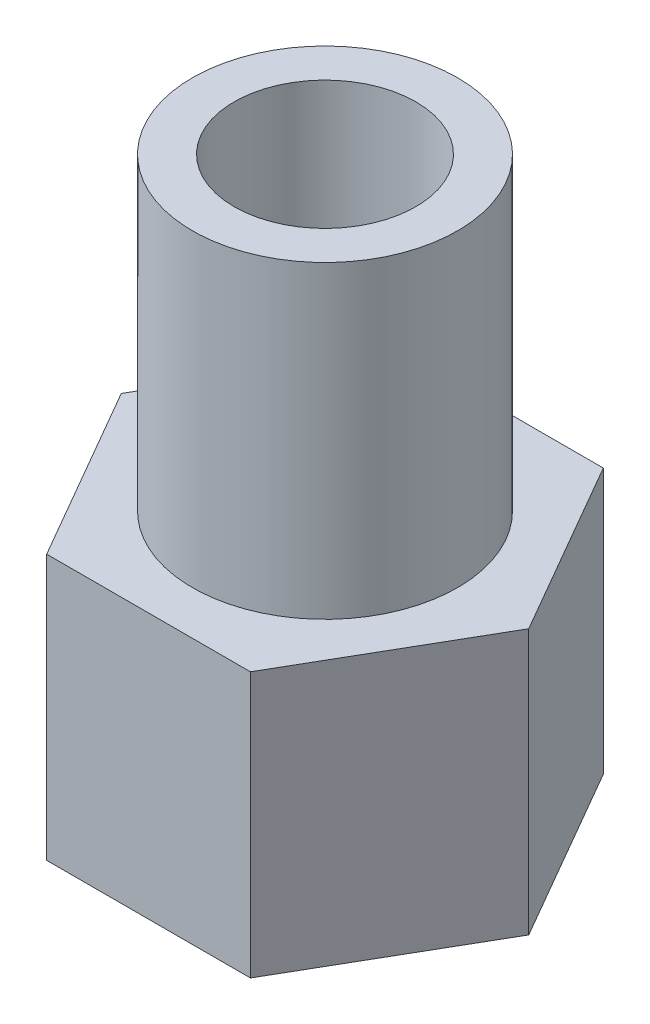
ISO-10303-21;
HEADER;
FILE_DESCRIPTION(('STEP AP214'),'2;1');
FILE_NAME('part.step','',(''),(''),'','','');
FILE_SCHEMA(('AUTOMOTIVE_DESIGN { 1 0 10303 214 1 1 1 1 }'));
ENDSEC;
DATA;
#1=APPLICATION_CONTEXT('core data for automotive mechanical design processes');
#2=APPLICATION_PROTOCOL_DEFINITION('international standard','automotive_design',2000,#1);
#3=PRODUCT_CONTEXT('',#1,'mechanical');
#4=PRODUCT('Part','Part','',(#3));
#5=PRODUCT_RELATED_PRODUCT_CATEGORY('part','',(#4));
#6=PRODUCT_DEFINITION_FORMATION('','',#4);
#7=PRODUCT_DEFINITION_CONTEXT('part definition',#1,'design');
#8=PRODUCT_DEFINITION('design','',#6,#7);
#9=PRODUCT_DEFINITION_SHAPE('','',#8);
#10=(LENGTH_UNIT() NAMED_UNIT(*) SI_UNIT(.MILLI.,.METRE.));
#11=(NAMED_UNIT(*) PLANE_ANGLE_UNIT() SI_UNIT($,.RADIAN.));
#12=(NAMED_UNIT(*) SI_UNIT($,.STERADIAN.) SOLID_ANGLE_UNIT());
#13=UNCERTAINTY_MEASURE_WITH_UNIT(LENGTH_MEASURE(1.E-05),#10,'distance_accuracy_value','');
#14=(GEOMETRIC_REPRESENTATION_CONTEXT(3) GLOBAL_UNCERTAINTY_ASSIGNED_CONTEXT((#13)) GLOBAL_UNIT_ASSIGNED_CONTEXT((#10,
#11,#12)) REPRESENTATION_CONTEXT('',''));
#15=CARTESIAN_POINT('',(0.,0.,0.));
#16=DIRECTION('',(0.,0.,1.));
#17=DIRECTION('',(1.,0.,0.));
#18=AXIS2_PLACEMENT_3D('',#15,#16,#17);
#19=CARTESIAN_POINT('',(0.,9.525,0.));
#20=DIRECTION('',(0.,1.,0.));
#21=DIRECTION('',(0.,0.,1.));
#22=AXIS2_PLACEMENT_3D('',#19,#20,#21);
#23=PLANE('',#22);
#24=CARTESIAN_POINT('',(0.,9.525,0.));
#25=DIRECTION('',(0.,-1.,0.));
#26=DIRECTION('',(0.,0.,-1.));
#27=AXIS2_PLACEMENT_3D('',#24,#25,#26);
#28=CIRCLE('',#27,4.7625);
#29=CARTESIAN_POINT('',(0.,9.525,-4.7625));
#30=VERTEX_POINT('',#29);
#31=EDGE_CURVE('E21',#30,#30,#28,.F.);
#32=ORIENTED_EDGE('',*,*,#31,.F.);
#33=EDGE_LOOP('',(#32));
#34=FACE_BOUND('',#33,.T.);
#35=DIRECTION('',(0.5,0.,-0.866025403784439));
#36=VECTOR('',#35,1.);
#37=CARTESIAN_POINT('',(-3.65884186093542,9.525,-6.3373));
#38=LINE('',#37,#36);
#39=CARTESIAN_POINT('',(-3.65884186093542,9.525,-6.3373));
#40=VERTEX_POINT('',#39);
#41=CARTESIAN_POINT('',(-7.31768372187083,9.525,0.));
#42=VERTEX_POINT('',#41);
#43=EDGE_CURVE('E112',#40,#42,#38,.F.);
#44=ORIENTED_EDGE('',*,*,#43,.T.);
#45=DIRECTION('',(-0.5,0.,-0.866025403784439));
#46=VECTOR('',#45,1.);
#47=CARTESIAN_POINT('',(-7.31768372187083,9.525,0.));
#48=LINE('',#47,#46);
#49=CARTESIAN_POINT('',(-3.65884186093542,9.525,6.3373));
#50=VERTEX_POINT('',#49);
#51=EDGE_CURVE('E107',#42,#50,#48,.F.);
#52=ORIENTED_EDGE('',*,*,#51,.T.);
#53=DIRECTION('',(-1.,0.,0.));
#54=VECTOR('',#53,1.);
#55=CARTESIAN_POINT('',(-3.65884186093542,9.525,6.3373));
#56=LINE('',#55,#54);
#57=CARTESIAN_POINT('',(3.65884186093541,9.525,6.3373));
#58=VERTEX_POINT('',#57);
#59=EDGE_CURVE('E73',#50,#58,#56,.F.);
#60=ORIENTED_EDGE('',*,*,#59,.T.);
#61=DIRECTION('',(-0.5,0.,0.866025403784439));
#62=VECTOR('',#61,1.);
#63=CARTESIAN_POINT('',(3.65884186093542,9.525,6.3373));
#64=LINE('',#63,#62);
#65=CARTESIAN_POINT('',(7.31768372187083,9.525,0.));
#66=VERTEX_POINT('',#65);
#67=EDGE_CURVE('E72',#58,#66,#64,.F.);
#68=ORIENTED_EDGE('',*,*,#67,.T.);
#69=DIRECTION('',(0.5,0.,0.866025403784439));
#70=VECTOR('',#69,1.);
#71=CARTESIAN_POINT('',(7.31768372187083,9.525,0.));
#72=LINE('',#71,#70);
#73=CARTESIAN_POINT('',(3.65884186093542,9.525,-6.3373));
#74=VERTEX_POINT('',#73);
#75=EDGE_CURVE('E69',#66,#74,#72,.F.);
#76=ORIENTED_EDGE('',*,*,#75,.T.);
#77=DIRECTION('',(1.,0.,0.));
#78=VECTOR('',#77,1.);
#79=CARTESIAN_POINT('',(3.65884186093542,9.525,-6.3373));
#80=LINE('',#79,#78);
#81=EDGE_CURVE('E117',#74,#40,#80,.F.);
#82=ORIENTED_EDGE('',*,*,#81,.T.);
#83=EDGE_LOOP('',(#44,#52,#60,#68,#76,#82));
#84=FACE_BOUND('',#83,.T.);
#85=ADVANCED_FACE('F18',(#34,#84),#23,.T.);
#86=CARTESIAN_POINT('',(0.,20.6248,0.));
#87=DIRECTION('',(0.,-1.,0.));
#88=DIRECTION('',(0.,0.,-1.));
#89=AXIS2_PLACEMENT_3D('',#86,#87,#88);
#90=CYLINDRICAL_SURFACE('',#89,4.7625);
#91=ORIENTED_EDGE('',*,*,#31,.T.);
#92=EDGE_LOOP('',(#91));
#93=FACE_BOUND('',#92,.T.);
#94=CARTESIAN_POINT('',(0.,20.6248,0.));
#95=DIRECTION('',(0.,-1.,0.));
#96=DIRECTION('',(0.,0.,-1.));
#97=AXIS2_PLACEMENT_3D('',#94,#95,#96);
#98=CIRCLE('',#97,4.7625);
#99=CARTESIAN_POINT('',(0.,20.6248,-4.7625));
#100=VERTEX_POINT('',#99);
#101=EDGE_CURVE('E95',#100,#100,#98,.F.);
#102=ORIENTED_EDGE('',*,*,#101,.F.);
#103=EDGE_LOOP('',(#102));
#104=FACE_BOUND('',#103,.T.);
#105=ADVANCED_FACE('F224',(#93,#104),#90,.T.);
#106=CARTESIAN_POINT('',(3.65884186093542,9.525,6.3373));
#107=DIRECTION('',(-0.866025403784439,0.,-0.5));
#108=DIRECTION('',(-0.5,0.,0.866025403784439));
#109=AXIS2_PLACEMENT_3D('',#106,#107,#108);
#110=PLANE('',#109);
#111=DIRECTION('',(0.,1.,0.));
#112=VECTOR('',#111,1.);
#113=CARTESIAN_POINT('',(7.31768372187083,9.525,0.));
#114=LINE('',#113,#112);
#115=CARTESIAN_POINT('',(7.31768372187083,0.,0.));
#116=VERTEX_POINT('',#115);
#117=EDGE_CURVE('E78',#116,#66,#114,.T.);
#118=ORIENTED_EDGE('',*,*,#117,.T.);
#119=ORIENTED_EDGE('',*,*,#67,.F.);
#120=DIRECTION('',(0.,1.,0.));
#121=VECTOR('',#120,1.);
#122=CARTESIAN_POINT('',(3.65884186093542,9.525,6.3373));
#123=LINE('',#122,#121);
#124=CARTESIAN_POINT('',(3.65884186093542,0.,6.3373));
#125=VERTEX_POINT('',#124);
#126=EDGE_CURVE('E97',#58,#125,#123,.F.);
#127=ORIENTED_EDGE('',*,*,#126,.T.);
#128=DIRECTION('',(0.5,0.,-0.866025403784439));
#129=VECTOR('',#128,1.);
#130=CARTESIAN_POINT('',(3.65884186093542,0.,6.3373));
#131=LINE('',#130,#129);
#132=EDGE_CURVE('E89',#125,#116,#131,.T.);
#133=ORIENTED_EDGE('',*,*,#132,.T.);
#134=EDGE_LOOP('',(#118,#119,#127,#133));
#135=FACE_BOUND('',#134,.T.);
#136=ADVANCED_FACE('F88',(#135),#110,.F.);
#137=CARTESIAN_POINT('',(7.31768372187083,9.525,0.));
#138=DIRECTION('',(-0.866025403784439,0.,0.5));
#139=DIRECTION('',(0.5,0.,0.866025403784439));
#140=AXIS2_PLACEMENT_3D('',#137,#138,#139);
#141=PLANE('',#140);
#142=DIRECTION('',(0.,1.,0.));
#143=VECTOR('',#142,1.);
#144=CARTESIAN_POINT('',(3.65884186093542,9.525,-6.3373));
#145=LINE('',#144,#143);
#146=CARTESIAN_POINT('',(3.65884186093542,0.,-6.3373));
#147=VERTEX_POINT('',#146);
#148=EDGE_CURVE('E85',#147,#74,#145,.T.);
#149=ORIENTED_EDGE('',*,*,#148,.T.);
#150=ORIENTED_EDGE('',*,*,#75,.F.);
#151=ORIENTED_EDGE('',*,*,#117,.F.);
#152=DIRECTION('',(-0.5,0.,-0.866025403784439));
#153=VECTOR('',#152,1.);
#154=CARTESIAN_POINT('',(7.31768372187083,0.,0.));
#155=LINE('',#154,#153);
#156=EDGE_CURVE('E100',#116,#147,#155,.T.);
#157=ORIENTED_EDGE('',*,*,#156,.T.);
#158=EDGE_LOOP('',(#149,#150,#151,#157));
#159=FACE_BOUND('',#158,.T.);
#160=ADVANCED_FACE('F82',(#159),#141,.F.);
#161=CARTESIAN_POINT('',(3.65884186093542,9.525,-6.3373));
#162=DIRECTION('',(0.,0.,1.));
#163=DIRECTION('',(1.,0.,0.));
#164=AXIS2_PLACEMENT_3D('',#161,#162,#163);
#165=PLANE('',#164);
#166=DIRECTION('',(0.,1.,0.));
#167=VECTOR('',#166,1.);
#168=CARTESIAN_POINT('',(-3.65884186093542,9.525,-6.3373));
#169=LINE('',#168,#167);
#170=CARTESIAN_POINT('',(-3.65884186093542,0.,-6.3373));
#171=VERTEX_POINT('',#170);
#172=EDGE_CURVE('E114',#171,#40,#169,.T.);
#173=ORIENTED_EDGE('',*,*,#172,.T.);
#174=ORIENTED_EDGE('',*,*,#81,.F.);
#175=ORIENTED_EDGE('',*,*,#148,.F.);
#176=DIRECTION('',(1.,0.,0.));
#177=VECTOR('',#176,1.);
#178=CARTESIAN_POINT('',(0.,0.,-6.3373));
#179=LINE('',#178,#177);
#180=EDGE_CURVE('E128',#147,#171,#179,.F.);
#181=ORIENTED_EDGE('',*,*,#180,.T.);
#182=EDGE_LOOP('',(#173,#174,#175,#181));
#183=FACE_BOUND('',#182,.T.);
#184=ADVANCED_FACE('F126',(#183),#165,.F.);
#185=CARTESIAN_POINT('',(-3.65884186093542,9.525,-6.3373));
#186=DIRECTION('',(0.866025403784439,0.,0.5));
#187=DIRECTION('',(0.5,0.,-0.866025403784439));
#188=AXIS2_PLACEMENT_3D('',#185,#186,#187);
#189=PLANE('',#188);
#190=DIRECTION('',(0.,1.,0.));
#191=VECTOR('',#190,1.);
#192=CARTESIAN_POINT('',(-7.31768372187083,9.525,0.));
#193=LINE('',#192,#191);
#194=CARTESIAN_POINT('',(-7.31768372187083,0.,0.));
#195=VERTEX_POINT('',#194);
#196=EDGE_CURVE('E109',#195,#42,#193,.T.);
#197=ORIENTED_EDGE('',*,*,#196,.T.);
#198=ORIENTED_EDGE('',*,*,#43,.F.);
#199=ORIENTED_EDGE('',*,*,#172,.F.);
#200=DIRECTION('',(-0.5,0.,0.866025403784439));
#201=VECTOR('',#200,1.);
#202=CARTESIAN_POINT('',(-3.65884186093542,0.,-6.3373));
#203=LINE('',#202,#201);
#204=EDGE_CURVE('E130',#171,#195,#203,.T.);
#205=ORIENTED_EDGE('',*,*,#204,.T.);
#206=EDGE_LOOP('',(#197,#198,#199,#205));
#207=FACE_BOUND('',#206,.T.);
#208=ADVANCED_FACE('F122',(#207),#189,.F.);
#209=CARTESIAN_POINT('',(-7.31768372187083,9.525,0.));
#210=DIRECTION('',(0.866025403784439,0.,-0.5));
#211=DIRECTION('',(-0.5,0.,-0.866025403784439));
#212=AXIS2_PLACEMENT_3D('',#209,#210,#211);
#213=PLANE('',#212);
#214=DIRECTION('',(0.,1.,0.));
#215=VECTOR('',#214,1.);
#216=CARTESIAN_POINT('',(-3.65884186093542,9.525,6.3373));
#217=LINE('',#216,#215);
#218=CARTESIAN_POINT('',(-3.65884186093542,0.,6.3373));
#219=VERTEX_POINT('',#218);
#220=EDGE_CURVE('E36',#219,#50,#217,.T.);
#221=ORIENTED_EDGE('',*,*,#220,.T.);
#222=ORIENTED_EDGE('',*,*,#51,.F.);
#223=ORIENTED_EDGE('',*,*,#196,.F.);
#224=DIRECTION('',(0.5,0.,0.866025403784439));
#225=VECTOR('',#224,1.);
#226=CARTESIAN_POINT('',(-7.31768372187083,0.,0.));
#227=LINE('',#226,#225);
#228=EDGE_CURVE('E132',#195,#219,#227,.T.);
#229=ORIENTED_EDGE('',*,*,#228,.T.);
#230=EDGE_LOOP('',(#221,#222,#223,#229));
#231=FACE_BOUND('',#230,.T.);
#232=ADVANCED_FACE('F142',(#231),#213,.F.);
#233=CARTESIAN_POINT('',(-3.65884186093542,9.525,6.3373));
#234=DIRECTION('',(0.,0.,-1.));
#235=DIRECTION('',(-1.,0.,0.));
#236=AXIS2_PLACEMENT_3D('',#233,#234,#235);
#237=PLANE('',#236);
#238=ORIENTED_EDGE('',*,*,#126,.F.);
#239=ORIENTED_EDGE('',*,*,#59,.F.);
#240=ORIENTED_EDGE('',*,*,#220,.F.);
#241=DIRECTION('',(1.,0.,0.));
#242=VECTOR('',#241,1.);
#243=CARTESIAN_POINT('',(0.,0.,6.3373));
#244=LINE('',#243,#242);
#245=EDGE_CURVE('E94',#219,#125,#244,.T.);
#246=ORIENTED_EDGE('',*,*,#245,.T.);
#247=EDGE_LOOP('',(#238,#239,#240,#246));
#248=FACE_BOUND('',#247,.T.);
#249=ADVANCED_FACE('F137',(#248),#237,.F.);
#250=CARTESIAN_POINT('',(0.,20.6248,0.));
#251=DIRECTION('',(0.,1.,0.));
#252=DIRECTION('',(0.,0.,1.));
#253=AXIS2_PLACEMENT_3D('',#250,#251,#252);
#254=PLANE('',#253);
#255=ORIENTED_EDGE('',*,*,#101,.T.);
#256=EDGE_LOOP('',(#255));
#257=FACE_BOUND('',#256,.T.);
#258=CARTESIAN_POINT('',(0.,20.6248,0.));
#259=DIRECTION('',(0.,1.,0.));
#260=DIRECTION('',(0.,0.,1.));
#261=AXIS2_PLACEMENT_3D('',#258,#259,#260);
#262=CIRCLE('',#261,3.2639);
#263=CARTESIAN_POINT('',(0.,20.6248,3.2639));
#264=VERTEX_POINT('',#263);
#265=EDGE_CURVE('E27',#264,#264,#262,.F.);
#266=ORIENTED_EDGE('',*,*,#265,.T.);
#267=EDGE_LOOP('',(#266));
#268=FACE_BOUND('',#267,.T.);
#269=ADVANCED_FACE('F150',(#257,#268),#254,.T.);
#270=CARTESIAN_POINT('',(0.,0.,0.));
#271=DIRECTION('',(0.,1.,0.));
#272=DIRECTION('',(0.,0.,1.));
#273=AXIS2_PLACEMENT_3D('',#270,#271,#272);
#274=PLANE('',#273);
#275=ORIENTED_EDGE('',*,*,#228,.F.);
#276=ORIENTED_EDGE('',*,*,#204,.F.);
#277=ORIENTED_EDGE('',*,*,#180,.F.);
#278=ORIENTED_EDGE('',*,*,#156,.F.);
#279=ORIENTED_EDGE('',*,*,#132,.F.);
#280=ORIENTED_EDGE('',*,*,#245,.F.);
#281=EDGE_LOOP('',(#275,#276,#277,#278,#279,#280));
#282=FACE_BOUND('',#281,.T.);
#283=CARTESIAN_POINT('',(0.,0.,0.));
#284=DIRECTION('',(0.,1.,0.));
#285=DIRECTION('',(0.,0.,1.));
#286=AXIS2_PLACEMENT_3D('',#283,#284,#285);
#287=CIRCLE('',#286,3.2639);
#288=CARTESIAN_POINT('',(0.,0.,3.2639));
#289=VERTEX_POINT('',#288);
#290=EDGE_CURVE('E11',#289,#289,#287,.T.);
#291=ORIENTED_EDGE('',*,*,#290,.T.);
#292=EDGE_LOOP('',(#291));
#293=FACE_BOUND('',#292,.T.);
#294=ADVANCED_FACE('F139',(#282,#293),#274,.F.);
#295=CARTESIAN_POINT('',(0.,0.,0.));
#296=DIRECTION('',(0.,1.,0.));
#297=DIRECTION('',(0.,0.,1.));
#298=AXIS2_PLACEMENT_3D('',#295,#296,#297);
#299=CYLINDRICAL_SURFACE('',#298,3.2639);
#300=ORIENTED_EDGE('',*,*,#265,.F.);
#301=EDGE_LOOP('',(#300));
#302=FACE_BOUND('',#301,.T.);
#303=ORIENTED_EDGE('',*,*,#290,.F.);
#304=EDGE_LOOP('',(#303));
#305=FACE_BOUND('',#304,.T.);
#306=ADVANCED_FACE('F153',(#302,#305),#299,.F.);
#307=CLOSED_SHELL('',(#85,#105,#136,#160,#184,#208,#232,#249,#269,#294,#306));
#308=MANIFOLD_SOLID_BREP('B1',#307);
#309=ADVANCED_BREP_SHAPE_REPRESENTATION('',(#18,#308),#14);
#310=SHAPE_DEFINITION_REPRESENTATION(#9,#309);
ENDSEC;
END-ISO-10303-21;
